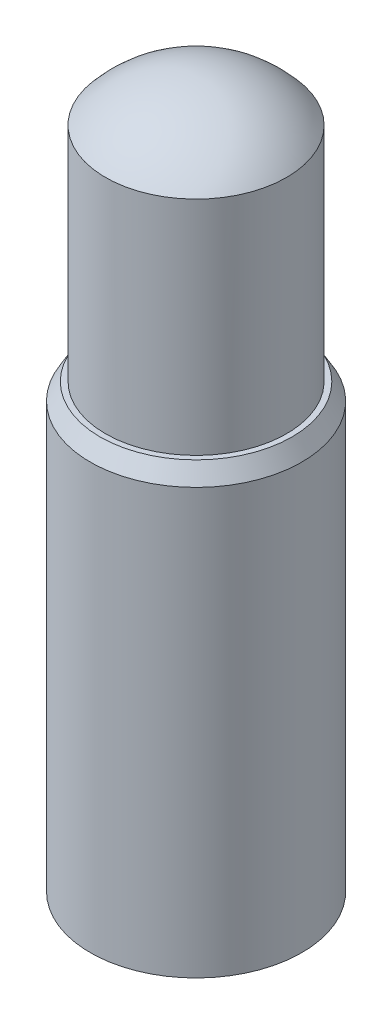
ISO-10303-21;
HEADER;
FILE_DESCRIPTION(('STEP AP214'),'2;1');
FILE_NAME('part.step','',(''),(''),'','','');
FILE_SCHEMA(('AUTOMOTIVE_DESIGN { 1 0 10303 214 1 1 1 1 }'));
ENDSEC;
DATA;
#1=APPLICATION_CONTEXT('core data for automotive mechanical design processes');
#2=APPLICATION_PROTOCOL_DEFINITION('international standard','automotive_design',2000,#1);
#3=PRODUCT_CONTEXT('',#1,'mechanical');
#4=PRODUCT('Part','Part','',(#3));
#5=PRODUCT_RELATED_PRODUCT_CATEGORY('part','',(#4));
#6=PRODUCT_DEFINITION_FORMATION('','',#4);
#7=PRODUCT_DEFINITION_CONTEXT('part definition',#1,'design');
#8=PRODUCT_DEFINITION('design','',#6,#7);
#9=PRODUCT_DEFINITION_SHAPE('','',#8);
#10=(LENGTH_UNIT() NAMED_UNIT(*) SI_UNIT(.MILLI.,.METRE.));
#11=(NAMED_UNIT(*) PLANE_ANGLE_UNIT() SI_UNIT($,.RADIAN.));
#12=(NAMED_UNIT(*) SI_UNIT($,.STERADIAN.) SOLID_ANGLE_UNIT());
#13=UNCERTAINTY_MEASURE_WITH_UNIT(LENGTH_MEASURE(1.E-05),#10,'distance_accuracy_value','');
#14=(GEOMETRIC_REPRESENTATION_CONTEXT(3) GLOBAL_UNCERTAINTY_ASSIGNED_CONTEXT((#13)) GLOBAL_UNIT_ASSIGNED_CONTEXT((#10,
#11,#12)) REPRESENTATION_CONTEXT('',''));
#15=CARTESIAN_POINT('',(0.,0.,0.));
#16=DIRECTION('',(0.,0.,1.));
#17=DIRECTION('',(1.,0.,0.));
#18=AXIS2_PLACEMENT_3D('',#15,#16,#17);
#19=CARTESIAN_POINT('',(-3.275,4.04,0.));
#20=DIRECTION('',(0.,-1.,0.));
#21=DIRECTION('',(0.,0.,-1.));
#22=AXIS2_PLACEMENT_3D('',#19,#20,#21);
#23=PLANE('',#22);
#24=CARTESIAN_POINT('',(-3.81,4.04,0.));
#25=DIRECTION('',(0.,-1.,0.));
#26=DIRECTION('',(0.,0.,-1.));
#27=AXIS2_PLACEMENT_3D('',#24,#25,#26);
#28=CIRCLE('',#27,0.567264973081037);
#29=CARTESIAN_POINT('',(-3.81,4.04,-0.567264973081037));
#30=VERTEX_POINT('',#29);
#31=EDGE_CURVE('E41',#30,#30,#28,.T.);
#32=ORIENTED_EDGE('',*,*,#31,.F.);
#33=EDGE_LOOP('',(#32));
#34=FACE_BOUND('',#33,.T.);
#35=CARTESIAN_POINT('',(-3.81,4.04,0.));
#36=DIRECTION('',(0.,-1.,0.));
#37=DIRECTION('',(0.,0.,-1.));
#38=AXIS2_PLACEMENT_3D('',#35,#36,#37);
#39=CIRCLE('',#38,0.535);
#40=CARTESIAN_POINT('',(-3.81,4.04,-0.535));
#41=VERTEX_POINT('',#40);
#42=EDGE_CURVE('E10',#41,#41,#39,.T.);
#43=ORIENTED_EDGE('',*,*,#42,.T.);
#44=EDGE_LOOP('',(#43));
#45=FACE_BOUND('',#44,.T.);
#46=ADVANCED_FACE('F14',(#34,#45),#23,.F.);
#47=CARTESIAN_POINT('',(-3.81,5.6,0.));
#48=DIRECTION('',(0.,-1.,0.));
#49=DIRECTION('',(0.,0.,-1.));
#50=AXIS2_PLACEMENT_3D('',#47,#48,#49);
#51=CYLINDRICAL_SURFACE('',#50,0.535);
#52=ORIENTED_EDGE('',*,*,#42,.F.);
#53=EDGE_LOOP('',(#52));
#54=FACE_BOUND('',#53,.T.);
#55=CARTESIAN_POINT('',(-3.81,5.35141444372107,0.));
#56=DIRECTION('',(0.,-1.,0.));
#57=DIRECTION('',(0.,0.,-1.));
#58=AXIS2_PLACEMENT_3D('',#55,#56,#57);
#59=CIRCLE('',#58,0.535);
#60=CARTESIAN_POINT('',(-3.81,5.35141444372107,-0.535));
#61=VERTEX_POINT('',#60);
#62=EDGE_CURVE('E21',#61,#61,#59,.T.);
#63=ORIENTED_EDGE('',*,*,#62,.T.);
#64=EDGE_LOOP('',(#63));
#65=FACE_BOUND('',#64,.T.);
#66=ADVANCED_FACE('F50',(#54,#65),#51,.T.);
#67=CARTESIAN_POINT('',(-3.81,4.9,0.));
#68=DIRECTION('',(0.,-1.,0.));
#69=DIRECTION('',(1.,0.,0.));
#70=AXIS2_PLACEMENT_3D('',#67,#68,#69);
#71=SPHERICAL_SURFACE('',#70,0.7);
#72=ORIENTED_EDGE('',*,*,#62,.F.);
#73=EDGE_LOOP('',(#72));
#74=FACE_BOUND('',#73,.T.);
#75=ADVANCED_FACE('F55',(#74),#71,.T.);
#76=CARTESIAN_POINT('',(-3.185,1.43,0.));
#77=DIRECTION('',(0.,1.,0.));
#78=DIRECTION('',(0.,0.,1.));
#79=AXIS2_PLACEMENT_3D('',#76,#77,#78);
#80=PLANE('',#79);
#81=CARTESIAN_POINT('',(-3.81,1.43,0.));
#82=DIRECTION('',(0.,-1.,0.));
#83=DIRECTION('',(0.,0.,-1.));
#84=AXIS2_PLACEMENT_3D('',#81,#82,#83);
#85=CIRCLE('',#84,0.625);
#86=CARTESIAN_POINT('',(-3.81,1.43,-0.625));
#87=VERTEX_POINT('',#86);
#88=EDGE_CURVE('E29',#87,#87,#85,.T.);
#89=ORIENTED_EDGE('',*,*,#88,.T.);
#90=EDGE_LOOP('',(#89));
#91=FACE_BOUND('',#90,.T.);
#92=ADVANCED_FACE('F60',(#91),#80,.F.);
#93=CARTESIAN_POINT('',(-3.81,5.6,0.));
#94=DIRECTION('',(0.,-1.,0.));
#95=DIRECTION('',(0.,0.,-1.));
#96=AXIS2_PLACEMENT_3D('',#93,#94,#95);
#97=CYLINDRICAL_SURFACE('',#96,0.625);
#98=ORIENTED_EDGE('',*,*,#88,.F.);
#99=EDGE_LOOP('',(#98));
#100=FACE_BOUND('',#99,.T.);
#101=CARTESIAN_POINT('',(-3.81,3.94,0.));
#102=DIRECTION('',(0.,-1.,0.));
#103=DIRECTION('',(0.,0.,-1.));
#104=AXIS2_PLACEMENT_3D('',#101,#102,#103);
#105=CIRCLE('',#104,0.625);
#106=CARTESIAN_POINT('',(-3.81,3.94,-0.625));
#107=VERTEX_POINT('',#106);
#108=EDGE_CURVE('E35',#107,#107,#105,.T.);
#109=ORIENTED_EDGE('',*,*,#108,.T.);
#110=EDGE_LOOP('',(#109));
#111=FACE_BOUND('',#110,.T.);
#112=ADVANCED_FACE('F66',(#100,#111),#97,.T.);
#113=CARTESIAN_POINT('',(-3.81,4.04,0.));
#114=DIRECTION('',(0.,-1.,0.));
#115=DIRECTION('',(0.,0.,-1.));
#116=AXIS2_PLACEMENT_3D('',#113,#114,#115);
#117=CONICAL_SURFACE('',#116,0.567264973081037,0.523598775598299);
#118=ORIENTED_EDGE('',*,*,#108,.F.);
#119=EDGE_LOOP('',(#118));
#120=FACE_BOUND('',#119,.T.);
#121=ORIENTED_EDGE('',*,*,#31,.T.);
#122=EDGE_LOOP('',(#121));
#123=FACE_BOUND('',#122,.T.);
#124=ADVANCED_FACE('F47',(#120,#123),#117,.T.);
#125=CLOSED_SHELL('',(#46,#66,#75,#92,#112,#124));
#126=MANIFOLD_SOLID_BREP('B1',#125);
#127=ADVANCED_BREP_SHAPE_REPRESENTATION('',(#18,#126),#14);
#128=SHAPE_DEFINITION_REPRESENTATION(#9,#127);
ENDSEC;
END-ISO-10303-21;
